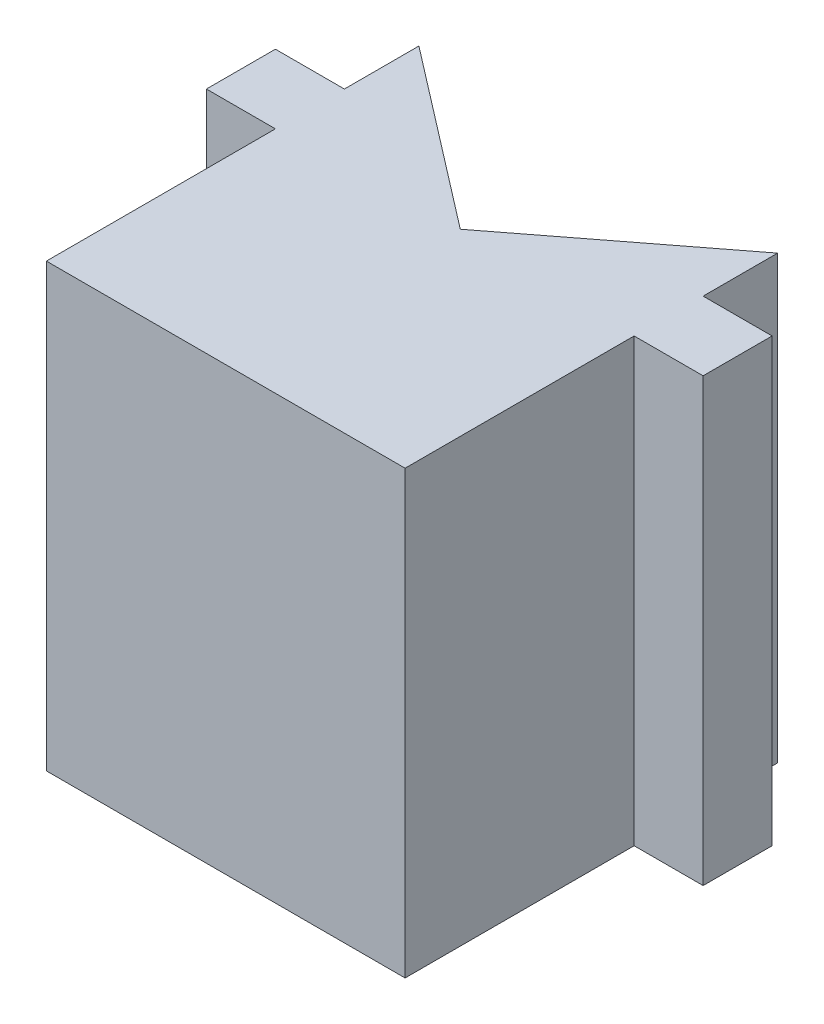
ISO-10303-21;
HEADER;
FILE_DESCRIPTION(('STEP AP214'),'2;1');
FILE_NAME('part.step','',(''),(''),'','','');
FILE_SCHEMA(('AUTOMOTIVE_DESIGN { 1 0 10303 214 1 1 1 1 }'));
ENDSEC;
DATA;
#1=APPLICATION_CONTEXT('core data for automotive mechanical design processes');
#2=APPLICATION_PROTOCOL_DEFINITION('international standard','automotive_design',2000,#1);
#3=PRODUCT_CONTEXT('',#1,'mechanical');
#4=PRODUCT('Part','Part','',(#3));
#5=PRODUCT_RELATED_PRODUCT_CATEGORY('part','',(#4));
#6=PRODUCT_DEFINITION_FORMATION('','',#4);
#7=PRODUCT_DEFINITION_CONTEXT('part definition',#1,'design');
#8=PRODUCT_DEFINITION('design','',#6,#7);
#9=PRODUCT_DEFINITION_SHAPE('','',#8);
#10=(LENGTH_UNIT() NAMED_UNIT(*) SI_UNIT(.MILLI.,.METRE.));
#11=(NAMED_UNIT(*) PLANE_ANGLE_UNIT() SI_UNIT($,.RADIAN.));
#12=(NAMED_UNIT(*) SI_UNIT($,.STERADIAN.) SOLID_ANGLE_UNIT());
#13=UNCERTAINTY_MEASURE_WITH_UNIT(LENGTH_MEASURE(1.E-05),#10,'distance_accuracy_value','');
#14=(GEOMETRIC_REPRESENTATION_CONTEXT(3) GLOBAL_UNCERTAINTY_ASSIGNED_CONTEXT((#13)) GLOBAL_UNIT_ASSIGNED_CONTEXT((#10,
#11,#12)) REPRESENTATION_CONTEXT('',''));
#15=CARTESIAN_POINT('',(0.,0.,0.));
#16=DIRECTION('',(0.,0.,1.));
#17=DIRECTION('',(1.,0.,0.));
#18=AXIS2_PLACEMENT_3D('',#15,#16,#17);
#19=CARTESIAN_POINT('',(-16.571375464684,40.64,-21.5427881040892));
#20=DIRECTION('',(0.609710760849692,0.,0.7926239891046));
#21=DIRECTION('',(0.7926239891046,0.,-0.609710760849693));
#22=AXIS2_PLACEMENT_3D('',#19,#20,#21);
#23=PLANE('',#22);
#24=DIRECTION('',(-0.7926239891046,0.,0.609710760849692));
#25=VECTOR('',#24,1.);
#26=CARTESIAN_POINT('',(0.,2.54,-34.29));
#27=LINE('',#26,#25);
#28=CARTESIAN_POINT('',(0.,2.54,-34.29));
#29=VERTEX_POINT('',#28);
#30=CARTESIAN_POINT('',(-16.51,2.54,-21.59));
#31=VERTEX_POINT('',#30);
#32=EDGE_CURVE('E48',#29,#31,#27,.T.);
#33=ORIENTED_EDGE('',*,*,#32,.T.);
#34=DIRECTION('',(0.,-1.,0.));
#35=VECTOR('',#34,1.);
#36=CARTESIAN_POINT('',(-16.51,40.64,-21.59));
#37=LINE('',#36,#35);
#38=CARTESIAN_POINT('',(-16.51,40.64,-21.59));
#39=VERTEX_POINT('',#38);
#40=EDGE_CURVE('E11',#39,#31,#37,.T.);
#41=ORIENTED_EDGE('',*,*,#40,.F.);
#42=DIRECTION('',(-0.7926239891046,0.,0.609710760849693));
#43=VECTOR('',#42,1.);
#44=CARTESIAN_POINT('',(-16.571375464684,40.64,-21.5427881040892));
#45=LINE('',#44,#43);
#46=CARTESIAN_POINT('',(0.,40.64,-34.29));
#47=VERTEX_POINT('',#46);
#48=EDGE_CURVE('E166',#47,#39,#45,.T.);
#49=ORIENTED_EDGE('',*,*,#48,.F.);
#50=DIRECTION('',(0.,-1.,0.));
#51=VECTOR('',#50,1.);
#52=CARTESIAN_POINT('',(0.,40.64,-34.29));
#53=LINE('',#52,#51);
#54=EDGE_CURVE('E212',#47,#29,#53,.T.);
#55=ORIENTED_EDGE('',*,*,#54,.T.);
#56=EDGE_LOOP('',(#33,#41,#49,#55));
#57=FACE_BOUND('',#56,.T.);
#58=ADVANCED_FACE('F34',(#57),#23,.F.);
#59=CARTESIAN_POINT('',(4.29628252788104,40.64,-5.58516728624535));
#60=DIRECTION('',(-0.609710760849692,0.,0.7926239891046));
#61=DIRECTION('',(0.7926239891046,0.,0.609710760849693));
#62=AXIS2_PLACEMENT_3D('',#59,#60,#61);
#63=PLANE('',#62);
#64=DIRECTION('',(-0.7926239891046,0.,-0.609710760849692));
#65=VECTOR('',#64,1.);
#66=CARTESIAN_POINT('',(-16.51,2.54,-21.59));
#67=LINE('',#66,#65);
#68=CARTESIAN_POINT('',(-33.02,2.54,-34.29));
#69=VERTEX_POINT('',#68);
#70=EDGE_CURVE('E54',#31,#69,#67,.T.);
#71=ORIENTED_EDGE('',*,*,#70,.T.);
#72=DIRECTION('',(0.,-1.,0.));
#73=VECTOR('',#72,1.);
#74=CARTESIAN_POINT('',(-33.02,40.64,-34.29));
#75=LINE('',#74,#73);
#76=CARTESIAN_POINT('',(-33.02,40.64,-34.29));
#77=VERTEX_POINT('',#76);
#78=EDGE_CURVE('E41',#77,#69,#75,.T.);
#79=ORIENTED_EDGE('',*,*,#78,.F.);
#80=DIRECTION('',(-0.7926239891046,0.,-0.609710760849693));
#81=VECTOR('',#80,1.);
#82=CARTESIAN_POINT('',(4.29628252788104,40.64,-5.58516728624535));
#83=LINE('',#82,#81);
#84=EDGE_CURVE('E169',#39,#77,#83,.T.);
#85=ORIENTED_EDGE('',*,*,#84,.F.);
#86=ORIENTED_EDGE('',*,*,#40,.T.);
#87=EDGE_LOOP('',(#71,#79,#85,#86));
#88=FACE_BOUND('',#87,.T.);
#89=ADVANCED_FACE('F246',(#88),#63,.F.);
#90=CARTESIAN_POINT('',(-33.02,40.64,0.));
#91=DIRECTION('',(-1.,0.,0.));
#92=DIRECTION('',(0.,0.,1.));
#93=AXIS2_PLACEMENT_3D('',#90,#91,#92);
#94=PLANE('',#93);
#95=DIRECTION('',(0.,0.,-1.));
#96=VECTOR('',#95,1.);
#97=CARTESIAN_POINT('',(-33.02,0.,0.));
#98=LINE('',#97,#96);
#99=CARTESIAN_POINT('',(-33.02,0.,-27.432));
#100=VERTEX_POINT('',#99);
#101=CARTESIAN_POINT('',(-33.02,0.,-34.29));
#102=VERTEX_POINT('',#101);
#103=EDGE_CURVE('E137',#100,#102,#98,.T.);
#104=ORIENTED_EDGE('',*,*,#103,.F.);
#105=DIRECTION('',(0.,-1.,0.));
#106=VECTOR('',#105,1.);
#107=CARTESIAN_POINT('',(-33.02,40.64,-27.432));
#108=LINE('',#107,#106);
#109=CARTESIAN_POINT('',(-33.02,40.64,-27.432));
#110=VERTEX_POINT('',#109);
#111=EDGE_CURVE('E237',#110,#100,#108,.T.);
#112=ORIENTED_EDGE('',*,*,#111,.F.);
#113=DIRECTION('',(0.,0.,-1.));
#114=VECTOR('',#113,1.);
#115=CARTESIAN_POINT('',(-33.02,40.64,0.));
#116=LINE('',#115,#114);
#117=EDGE_CURVE('E172',#110,#77,#116,.T.);
#118=ORIENTED_EDGE('',*,*,#117,.T.);
#119=ORIENTED_EDGE('',*,*,#78,.T.);
#120=DIRECTION('',(0.,-1.,0.));
#121=VECTOR('',#120,1.);
#122=CARTESIAN_POINT('',(-33.02,2.54,-34.29));
#123=LINE('',#122,#121);
#124=EDGE_CURVE('E150',#69,#102,#123,.T.);
#125=ORIENTED_EDGE('',*,*,#124,.T.);
#126=EDGE_LOOP('',(#104,#112,#118,#119,#125));
#127=FACE_BOUND('',#126,.T.);
#128=ADVANCED_FACE('F151',(#127),#94,.T.);
#129=CARTESIAN_POINT('',(0.,40.64,-27.432));
#130=DIRECTION('',(0.,0.,1.));
#131=DIRECTION('',(1.,0.,0.));
#132=AXIS2_PLACEMENT_3D('',#129,#130,#131);
#133=PLANE('',#132);
#134=DIRECTION('',(-1.,0.,0.));
#135=VECTOR('',#134,1.);
#136=CARTESIAN_POINT('',(0.,0.,-27.432));
#137=LINE('',#136,#135);
#138=CARTESIAN_POINT('',(-39.37,0.,-27.432));
#139=VERTEX_POINT('',#138);
#140=EDGE_CURVE('E144',#100,#139,#137,.T.);
#141=ORIENTED_EDGE('',*,*,#140,.T.);
#142=DIRECTION('',(0.,-1.,0.));
#143=VECTOR('',#142,1.);
#144=CARTESIAN_POINT('',(-39.37,40.64,-27.432));
#145=LINE('',#144,#143);
#146=CARTESIAN_POINT('',(-39.37,40.64,-27.432));
#147=VERTEX_POINT('',#146);
#148=EDGE_CURVE('E234',#147,#139,#145,.T.);
#149=ORIENTED_EDGE('',*,*,#148,.F.);
#150=DIRECTION('',(-1.,0.,0.));
#151=VECTOR('',#150,1.);
#152=CARTESIAN_POINT('',(0.,40.64,-27.432));
#153=LINE('',#152,#151);
#154=EDGE_CURVE('E174',#110,#147,#153,.T.);
#155=ORIENTED_EDGE('',*,*,#154,.F.);
#156=ORIENTED_EDGE('',*,*,#111,.T.);
#157=EDGE_LOOP('',(#141,#149,#155,#156));
#158=FACE_BOUND('',#157,.T.);
#159=ADVANCED_FACE('F240',(#158),#133,.F.);
#160=CARTESIAN_POINT('',(-39.37,40.64,0.));
#161=DIRECTION('',(1.,0.,0.));
#162=DIRECTION('',(0.,0.,-1.));
#163=AXIS2_PLACEMENT_3D('',#160,#161,#162);
#164=PLANE('',#163);
#165=DIRECTION('',(0.,0.,1.));
#166=VECTOR('',#165,1.);
#167=CARTESIAN_POINT('',(-39.37,0.,0.));
#168=LINE('',#167,#166);
#169=CARTESIAN_POINT('',(-39.37,0.,-21.082));
#170=VERTEX_POINT('',#169);
#171=EDGE_CURVE('E195',#139,#170,#168,.T.);
#172=ORIENTED_EDGE('',*,*,#171,.T.);
#173=DIRECTION('',(0.,-1.,0.));
#174=VECTOR('',#173,1.);
#175=CARTESIAN_POINT('',(-39.37,40.64,-21.082));
#176=LINE('',#175,#174);
#177=CARTESIAN_POINT('',(-39.37,40.64,-21.082));
#178=VERTEX_POINT('',#177);
#179=EDGE_CURVE('E232',#178,#170,#176,.T.);
#180=ORIENTED_EDGE('',*,*,#179,.F.);
#181=DIRECTION('',(0.,0.,1.));
#182=VECTOR('',#181,1.);
#183=CARTESIAN_POINT('',(-39.37,40.64,0.));
#184=LINE('',#183,#182);
#185=EDGE_CURVE('E177',#147,#178,#184,.T.);
#186=ORIENTED_EDGE('',*,*,#185,.F.);
#187=ORIENTED_EDGE('',*,*,#148,.T.);
#188=EDGE_LOOP('',(#172,#180,#186,#187));
#189=FACE_BOUND('',#188,.T.);
#190=ADVANCED_FACE('F257',(#189),#164,.F.);
#191=CARTESIAN_POINT('',(0.,40.64,-21.082));
#192=DIRECTION('',(0.,0.,1.));
#193=DIRECTION('',(1.,0.,0.));
#194=AXIS2_PLACEMENT_3D('',#191,#192,#193);
#195=PLANE('',#194);
#196=DIRECTION('',(-1.,0.,0.));
#197=VECTOR('',#196,1.);
#198=CARTESIAN_POINT('',(0.,0.,-21.082));
#199=LINE('',#198,#197);
#200=CARTESIAN_POINT('',(-33.02,0.,-21.082));
#201=VERTEX_POINT('',#200);
#202=EDGE_CURVE('E198',#201,#170,#199,.T.);
#203=ORIENTED_EDGE('',*,*,#202,.F.);
#204=DIRECTION('',(0.,-1.,0.));
#205=VECTOR('',#204,1.);
#206=CARTESIAN_POINT('',(-33.02,40.64,-21.082));
#207=LINE('',#206,#205);
#208=CARTESIAN_POINT('',(-33.02,40.64,-21.082));
#209=VERTEX_POINT('',#208);
#210=EDGE_CURVE('E230',#209,#201,#207,.T.);
#211=ORIENTED_EDGE('',*,*,#210,.F.);
#212=DIRECTION('',(-1.,0.,0.));
#213=VECTOR('',#212,1.);
#214=CARTESIAN_POINT('',(0.,40.64,-21.082));
#215=LINE('',#214,#213);
#216=EDGE_CURVE('E179',#209,#178,#215,.T.);
#217=ORIENTED_EDGE('',*,*,#216,.T.);
#218=ORIENTED_EDGE('',*,*,#179,.T.);
#219=EDGE_LOOP('',(#203,#211,#217,#218));
#220=FACE_BOUND('',#219,.T.);
#221=ADVANCED_FACE('F260',(#220),#195,.T.);
#222=CARTESIAN_POINT('',(-33.02,0.,0.));
#223=VERTEX_POINT('',#222);
#224=EDGE_CURVE('E148',#223,#201,#98,.T.);
#225=ORIENTED_EDGE('',*,*,#224,.F.);
#226=DIRECTION('',(0.,-1.,0.));
#227=VECTOR('',#226,1.);
#228=CARTESIAN_POINT('',(-33.02,40.64,0.));
#229=LINE('',#228,#227);
#230=CARTESIAN_POINT('',(-33.02,40.64,0.));
#231=VERTEX_POINT('',#230);
#232=EDGE_CURVE('E228',#231,#223,#229,.T.);
#233=ORIENTED_EDGE('',*,*,#232,.F.);
#234=EDGE_CURVE('E175',#231,#209,#116,.T.);
#235=ORIENTED_EDGE('',*,*,#234,.T.);
#236=ORIENTED_EDGE('',*,*,#210,.T.);
#237=EDGE_LOOP('',(#225,#233,#235,#236));
#238=FACE_BOUND('',#237,.T.);
#239=ADVANCED_FACE('F253',(#238),#94,.T.);
#240=CARTESIAN_POINT('',(0.,40.64,0.));
#241=DIRECTION('',(0.,0.,1.));
#242=DIRECTION('',(1.,0.,0.));
#243=AXIS2_PLACEMENT_3D('',#240,#241,#242);
#244=PLANE('',#243);
#245=DIRECTION('',(-1.,0.,0.));
#246=VECTOR('',#245,1.);
#247=CARTESIAN_POINT('',(0.,0.,0.));
#248=LINE('',#247,#246);
#249=CARTESIAN_POINT('',(0.,0.,0.));
#250=VERTEX_POINT('',#249);
#251=EDGE_CURVE('E201',#250,#223,#248,.T.);
#252=ORIENTED_EDGE('',*,*,#251,.F.);
#253=DIRECTION('',(0.,-1.,0.));
#254=VECTOR('',#253,1.);
#255=CARTESIAN_POINT('',(0.,40.64,0.));
#256=LINE('',#255,#254);
#257=CARTESIAN_POINT('',(0.,40.64,0.));
#258=VERTEX_POINT('',#257);
#259=EDGE_CURVE('E226',#258,#250,#256,.T.);
#260=ORIENTED_EDGE('',*,*,#259,.F.);
#261=DIRECTION('',(-1.,0.,0.));
#262=VECTOR('',#261,1.);
#263=CARTESIAN_POINT('',(0.,40.64,0.));
#264=LINE('',#263,#262);
#265=EDGE_CURVE('E182',#258,#231,#264,.T.);
#266=ORIENTED_EDGE('',*,*,#265,.T.);
#267=ORIENTED_EDGE('',*,*,#232,.T.);
#268=EDGE_LOOP('',(#252,#260,#266,#267));
#269=FACE_BOUND('',#268,.T.);
#270=ADVANCED_FACE('F266',(#269),#244,.T.);
#271=CARTESIAN_POINT('',(0.,40.64,0.));
#272=DIRECTION('',(-1.,0.,0.));
#273=DIRECTION('',(0.,0.,1.));
#274=AXIS2_PLACEMENT_3D('',#271,#272,#273);
#275=PLANE('',#274);
#276=DIRECTION('',(0.,0.,-1.));
#277=VECTOR('',#276,1.);
#278=CARTESIAN_POINT('',(0.,0.,0.));
#279=LINE('',#278,#277);
#280=CARTESIAN_POINT('',(0.,0.,-21.082));
#281=VERTEX_POINT('',#280);
#282=EDGE_CURVE('E204',#250,#281,#279,.T.);
#283=ORIENTED_EDGE('',*,*,#282,.T.);
#284=DIRECTION('',(0.,-1.,0.));
#285=VECTOR('',#284,1.);
#286=CARTESIAN_POINT('',(0.,40.64,-21.082));
#287=LINE('',#286,#285);
#288=CARTESIAN_POINT('',(0.,40.64,-21.082));
#289=VERTEX_POINT('',#288);
#290=EDGE_CURVE('E223',#289,#281,#287,.T.);
#291=ORIENTED_EDGE('',*,*,#290,.F.);
#292=DIRECTION('',(0.,0.,-1.));
#293=VECTOR('',#292,1.);
#294=CARTESIAN_POINT('',(0.,40.64,0.));
#295=LINE('',#294,#293);
#296=EDGE_CURVE('E185',#258,#289,#295,.T.);
#297=ORIENTED_EDGE('',*,*,#296,.F.);
#298=ORIENTED_EDGE('',*,*,#259,.T.);
#299=EDGE_LOOP('',(#283,#291,#297,#298));
#300=FACE_BOUND('',#299,.T.);
#301=ADVANCED_FACE('F270',(#300),#275,.F.);
#302=CARTESIAN_POINT('',(0.,40.64,-21.082));
#303=DIRECTION('',(0.,0.,-1.));
#304=DIRECTION('',(-1.,0.,0.));
#305=AXIS2_PLACEMENT_3D('',#302,#303,#304);
#306=PLANE('',#305);
#307=DIRECTION('',(1.,0.,0.));
#308=VECTOR('',#307,1.);
#309=CARTESIAN_POINT('',(0.,0.,-21.082));
#310=LINE('',#309,#308);
#311=CARTESIAN_POINT('',(6.35,0.,-21.082));
#312=VERTEX_POINT('',#311);
#313=EDGE_CURVE('E206',#281,#312,#310,.T.);
#314=ORIENTED_EDGE('',*,*,#313,.T.);
#315=DIRECTION('',(0.,-1.,0.));
#316=VECTOR('',#315,1.);
#317=CARTESIAN_POINT('',(6.35,40.64,-21.082));
#318=LINE('',#317,#316);
#319=CARTESIAN_POINT('',(6.35,40.64,-21.082));
#320=VERTEX_POINT('',#319);
#321=EDGE_CURVE('E220',#320,#312,#318,.T.);
#322=ORIENTED_EDGE('',*,*,#321,.F.);
#323=DIRECTION('',(1.,0.,0.));
#324=VECTOR('',#323,1.);
#325=CARTESIAN_POINT('',(0.,40.64,-21.082));
#326=LINE('',#325,#324);
#327=EDGE_CURVE('E187',#289,#320,#326,.T.);
#328=ORIENTED_EDGE('',*,*,#327,.F.);
#329=ORIENTED_EDGE('',*,*,#290,.T.);
#330=EDGE_LOOP('',(#314,#322,#328,#329));
#331=FACE_BOUND('',#330,.T.);
#332=ADVANCED_FACE('F272',(#331),#306,.F.);
#333=CARTESIAN_POINT('',(6.35,40.64,0.));
#334=DIRECTION('',(-1.,0.,0.));
#335=DIRECTION('',(0.,0.,1.));
#336=AXIS2_PLACEMENT_3D('',#333,#334,#335);
#337=PLANE('',#336);
#338=DIRECTION('',(0.,0.,-1.));
#339=VECTOR('',#338,1.);
#340=CARTESIAN_POINT('',(6.35,0.,0.));
#341=LINE('',#340,#339);
#342=CARTESIAN_POINT('',(6.35,0.,-27.432));
#343=VERTEX_POINT('',#342);
#344=EDGE_CURVE('E208',#312,#343,#341,.T.);
#345=ORIENTED_EDGE('',*,*,#344,.T.);
#346=DIRECTION('',(0.,-1.,0.));
#347=VECTOR('',#346,1.);
#348=CARTESIAN_POINT('',(6.35,40.64,-27.432));
#349=LINE('',#348,#347);
#350=CARTESIAN_POINT('',(6.35,40.64,-27.432));
#351=VERTEX_POINT('',#350);
#352=EDGE_CURVE('E217',#351,#343,#349,.T.);
#353=ORIENTED_EDGE('',*,*,#352,.F.);
#354=DIRECTION('',(0.,0.,-1.));
#355=VECTOR('',#354,1.);
#356=CARTESIAN_POINT('',(6.35,40.64,0.));
#357=LINE('',#356,#355);
#358=EDGE_CURVE('E190',#320,#351,#357,.T.);
#359=ORIENTED_EDGE('',*,*,#358,.F.);
#360=ORIENTED_EDGE('',*,*,#321,.T.);
#361=EDGE_LOOP('',(#345,#353,#359,#360));
#362=FACE_BOUND('',#361,.T.);
#363=ADVANCED_FACE('F275',(#362),#337,.F.);
#364=CARTESIAN_POINT('',(0.,40.64,-27.432));
#365=DIRECTION('',(0.,0.,1.));
#366=DIRECTION('',(1.,0.,0.));
#367=AXIS2_PLACEMENT_3D('',#364,#365,#366);
#368=PLANE('',#367);
#369=DIRECTION('',(-1.,0.,0.));
#370=VECTOR('',#369,1.);
#371=CARTESIAN_POINT('',(0.,0.,-27.432));
#372=LINE('',#371,#370);
#373=CARTESIAN_POINT('',(0.,0.,-27.432));
#374=VERTEX_POINT('',#373);
#375=EDGE_CURVE('E210',#343,#374,#372,.T.);
#376=ORIENTED_EDGE('',*,*,#375,.T.);
#377=DIRECTION('',(0.,-1.,0.));
#378=VECTOR('',#377,1.);
#379=CARTESIAN_POINT('',(0.,40.64,-27.432));
#380=LINE('',#379,#378);
#381=CARTESIAN_POINT('',(0.,40.64,-27.432));
#382=VERTEX_POINT('',#381);
#383=EDGE_CURVE('E214',#382,#374,#380,.T.);
#384=ORIENTED_EDGE('',*,*,#383,.F.);
#385=DIRECTION('',(-1.,0.,0.));
#386=VECTOR('',#385,1.);
#387=CARTESIAN_POINT('',(0.,40.64,-27.432));
#388=LINE('',#387,#386);
#389=EDGE_CURVE('E192',#351,#382,#388,.T.);
#390=ORIENTED_EDGE('',*,*,#389,.F.);
#391=ORIENTED_EDGE('',*,*,#352,.T.);
#392=EDGE_LOOP('',(#376,#384,#390,#391));
#393=FACE_BOUND('',#392,.T.);
#394=ADVANCED_FACE('F279',(#393),#368,.F.);
#395=CARTESIAN_POINT('',(0.,0.,-34.29));
#396=VERTEX_POINT('',#395);
#397=EDGE_CURVE('E170',#374,#396,#279,.T.);
#398=ORIENTED_EDGE('',*,*,#397,.T.);
#399=DIRECTION('',(0.,-1.,0.));
#400=VECTOR('',#399,1.);
#401=CARTESIAN_POINT('',(0.,2.54,-34.29));
#402=LINE('',#401,#400);
#403=EDGE_CURVE('E146',#29,#396,#402,.T.);
#404=ORIENTED_EDGE('',*,*,#403,.F.);
#405=ORIENTED_EDGE('',*,*,#54,.F.);
#406=EDGE_CURVE('E188',#382,#47,#295,.T.);
#407=ORIENTED_EDGE('',*,*,#406,.F.);
#408=ORIENTED_EDGE('',*,*,#383,.T.);
#409=EDGE_LOOP('',(#398,#404,#405,#407,#408));
#410=FACE_BOUND('',#409,.T.);
#411=ADVANCED_FACE('F283',(#410),#275,.F.);
#412=CARTESIAN_POINT('',(0.,40.64,0.));
#413=DIRECTION('',(0.,1.,0.));
#414=DIRECTION('',(0.,0.,1.));
#415=AXIS2_PLACEMENT_3D('',#412,#413,#414);
#416=PLANE('',#415);
#417=ORIENTED_EDGE('',*,*,#48,.T.);
#418=ORIENTED_EDGE('',*,*,#84,.T.);
#419=ORIENTED_EDGE('',*,*,#117,.F.);
#420=ORIENTED_EDGE('',*,*,#154,.T.);
#421=ORIENTED_EDGE('',*,*,#185,.T.);
#422=ORIENTED_EDGE('',*,*,#216,.F.);
#423=ORIENTED_EDGE('',*,*,#234,.F.);
#424=ORIENTED_EDGE('',*,*,#265,.F.);
#425=ORIENTED_EDGE('',*,*,#296,.T.);
#426=ORIENTED_EDGE('',*,*,#327,.T.);
#427=ORIENTED_EDGE('',*,*,#358,.T.);
#428=ORIENTED_EDGE('',*,*,#389,.T.);
#429=ORIENTED_EDGE('',*,*,#406,.T.);
#430=EDGE_LOOP('',(#417,#418,#419,#420,#421,#422,#423,#424,#425,#426,#427,#428,#429));
#431=FACE_BOUND('',#430,.T.);
#432=ADVANCED_FACE('F244',(#431),#416,.T.);
#433=CARTESIAN_POINT('',(0.,0.,0.));
#434=DIRECTION('',(0.,1.,0.));
#435=DIRECTION('',(0.,0.,1.));
#436=AXIS2_PLACEMENT_3D('',#433,#434,#435);
#437=PLANE('',#436);
#438=DIRECTION('',(1.,0.,0.));
#439=VECTOR('',#438,1.);
#440=CARTESIAN_POINT('',(0.,0.,-34.29));
#441=LINE('',#440,#439);
#442=EDGE_CURVE('E142',#102,#396,#441,.T.);
#443=ORIENTED_EDGE('',*,*,#442,.T.);
#444=ORIENTED_EDGE('',*,*,#397,.F.);
#445=ORIENTED_EDGE('',*,*,#375,.F.);
#446=ORIENTED_EDGE('',*,*,#344,.F.);
#447=ORIENTED_EDGE('',*,*,#313,.F.);
#448=ORIENTED_EDGE('',*,*,#282,.F.);
#449=ORIENTED_EDGE('',*,*,#251,.T.);
#450=ORIENTED_EDGE('',*,*,#224,.T.);
#451=ORIENTED_EDGE('',*,*,#202,.T.);
#452=ORIENTED_EDGE('',*,*,#171,.F.);
#453=ORIENTED_EDGE('',*,*,#140,.F.);
#454=ORIENTED_EDGE('',*,*,#103,.T.);
#455=EDGE_LOOP('',(#443,#444,#445,#446,#447,#448,#449,#450,#451,#452,#453,#454));
#456=FACE_BOUND('',#455,.T.);
#457=ADVANCED_FACE('F139',(#456),#437,.F.);
#458=CARTESIAN_POINT('',(0.,2.54,-34.29));
#459=DIRECTION('',(0.,0.,-1.));
#460=DIRECTION('',(-1.,0.,0.));
#461=AXIS2_PLACEMENT_3D('',#458,#459,#460);
#462=PLANE('',#461);
#463=ORIENTED_EDGE('',*,*,#442,.F.);
#464=ORIENTED_EDGE('',*,*,#124,.F.);
#465=DIRECTION('',(1.,0.,0.));
#466=VECTOR('',#465,1.);
#467=CARTESIAN_POINT('',(0.,2.54,-34.29));
#468=LINE('',#467,#466);
#469=EDGE_CURVE('E156',#69,#29,#468,.T.);
#470=ORIENTED_EDGE('',*,*,#469,.T.);
#471=ORIENTED_EDGE('',*,*,#403,.T.);
#472=EDGE_LOOP('',(#463,#464,#470,#471));
#473=FACE_BOUND('',#472,.T.);
#474=ADVANCED_FACE('F159',(#473),#462,.T.);
#475=CARTESIAN_POINT('',(0.,2.54,0.));
#476=DIRECTION('',(0.,-1.,0.));
#477=DIRECTION('',(0.,0.,-1.));
#478=AXIS2_PLACEMENT_3D('',#475,#476,#477);
#479=PLANE('',#478);
#480=ORIENTED_EDGE('',*,*,#32,.F.);
#481=ORIENTED_EDGE('',*,*,#469,.F.);
#482=ORIENTED_EDGE('',*,*,#70,.F.);
#483=EDGE_LOOP('',(#480,#481,#482));
#484=FACE_BOUND('',#483,.T.);
#485=ADVANCED_FACE('F294',(#484),#479,.F.);
#486=CLOSED_SHELL('',(#58,#89,#128,#159,#190,#221,#239,#270,#301,#332,#363,#394,#411,#432,#457,
#474,#485));
#487=MANIFOLD_SOLID_BREP('B2',#486);
#488=ADVANCED_BREP_SHAPE_REPRESENTATION('',(#18,#487),#14);
#489=SHAPE_DEFINITION_REPRESENTATION(#9,#488);
ENDSEC;
END-ISO-10303-21;
